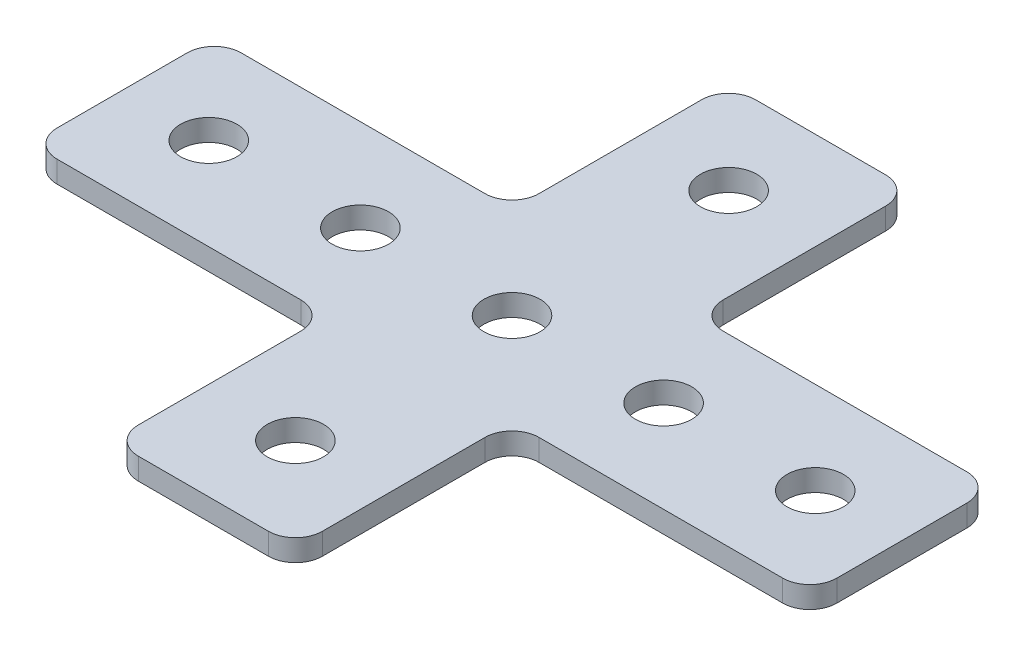
ISO-10303-21;
HEADER;
FILE_DESCRIPTION(('STEP AP214'),'2;1');
FILE_NAME('part.step','',(''),(''),'','','');
FILE_SCHEMA(('AUTOMOTIVE_DESIGN { 1 0 10303 214 1 1 1 1 }'));
ENDSEC;
DATA;
#1=APPLICATION_CONTEXT('core data for automotive mechanical design processes');
#2=APPLICATION_PROTOCOL_DEFINITION('international standard','automotive_design',2000,#1);
#3=PRODUCT_CONTEXT('',#1,'mechanical');
#4=PRODUCT('Part','Part','',(#3));
#5=PRODUCT_RELATED_PRODUCT_CATEGORY('part','',(#4));
#6=PRODUCT_DEFINITION_FORMATION('','',#4);
#7=PRODUCT_DEFINITION_CONTEXT('part definition',#1,'design');
#8=PRODUCT_DEFINITION('design','',#6,#7);
#9=PRODUCT_DEFINITION_SHAPE('','',#8);
#10=(LENGTH_UNIT() NAMED_UNIT(*) SI_UNIT(.MILLI.,.METRE.));
#11=(NAMED_UNIT(*) PLANE_ANGLE_UNIT() SI_UNIT($,.RADIAN.));
#12=(NAMED_UNIT(*) SI_UNIT($,.STERADIAN.) SOLID_ANGLE_UNIT());
#13=UNCERTAINTY_MEASURE_WITH_UNIT(LENGTH_MEASURE(1.E-05),#10,'distance_accuracy_value','');
#14=(GEOMETRIC_REPRESENTATION_CONTEXT(3) GLOBAL_UNCERTAINTY_ASSIGNED_CONTEXT((#13)) GLOBAL_UNIT_ASSIGNED_CONTEXT((#10,
#11,#12)) REPRESENTATION_CONTEXT('',''));
#15=CARTESIAN_POINT('',(0.,0.,0.));
#16=DIRECTION('',(0.,0.,1.));
#17=DIRECTION('',(1.,0.,0.));
#18=AXIS2_PLACEMENT_3D('',#15,#16,#17);
#19=CARTESIAN_POINT('',(-1.0203051665485,0.841431359764556,-0.820826933306762));
#20=DIRECTION('',(0.,-1.,0.));
#21=DIRECTION('',(0.,0.,-1.));
#22=AXIS2_PLACEMENT_3D('',#19,#20,#21);
#23=PLANE('',#22);
#24=CARTESIAN_POINT('',(-15.0203051665485,0.841431359764556,-0.820826933306748));
#25=DIRECTION('',(0.,-1.,0.));
#26=DIRECTION('',(0.,0.,1.));
#27=AXIS2_PLACEMENT_3D('',#24,#25,#26);
#28=CIRCLE('',#27,2.6);
#29=CARTESIAN_POINT('',(-15.0203051665485,0.841431359764556,1.77917306669325));
#30=VERTEX_POINT('',#29);
#31=EDGE_CURVE('E227',#30,#30,#28,.T.);
#32=ORIENTED_EDGE('',*,*,#31,.F.);
#33=EDGE_LOOP('',(#32));
#34=FACE_BOUND('',#33,.T.);
#35=CARTESIAN_POINT('',(-29.0203051665485,0.841431359764556,-0.820826933306745));
#36=DIRECTION('',(0.,-1.,0.));
#37=DIRECTION('',(0.,0.,1.));
#38=AXIS2_PLACEMENT_3D('',#35,#36,#37);
#39=CIRCLE('',#38,2.6);
#40=CARTESIAN_POINT('',(-29.0203051665485,0.841431359764556,1.77917306669325));
#41=VERTEX_POINT('',#40);
#42=EDGE_CURVE('E220',#41,#41,#39,.T.);
#43=ORIENTED_EDGE('',*,*,#42,.F.);
#44=EDGE_LOOP('',(#43));
#45=FACE_BOUND('',#44,.T.);
#46=CARTESIAN_POINT('',(-1.0203051665485,0.841431359764556,-0.820826933306762));
#47=DIRECTION('',(0.,1.,0.));
#48=DIRECTION('',(0.,0.,1.));
#49=AXIS2_PLACEMENT_3D('',#46,#47,#48);
#50=CIRCLE('',#49,2.6);
#51=CARTESIAN_POINT('',(-1.0203051665485,0.841431359764556,1.77917306669324));
#52=VERTEX_POINT('',#51);
#53=EDGE_CURVE('E269',#52,#52,#50,.T.);
#54=ORIENTED_EDGE('',*,*,#53,.T.);
#55=EDGE_LOOP('',(#54));
#56=FACE_BOUND('',#55,.T.);
#57=DIRECTION('',(1.,0.,0.));
#58=VECTOR('',#57,1.);
#59=CARTESIAN_POINT('',(-9.52030516654856,0.841431359764556,-29.3208269333067));
#60=LINE('',#59,#58);
#61=CARTESIAN_POINT('',(-7.02030516654855,0.841431359764556,-29.3208269333067));
#62=VERTEX_POINT('',#61);
#63=CARTESIAN_POINT('',(4.97969483345156,0.841431359764556,-29.3208269333067));
#64=VERTEX_POINT('',#63);
#65=EDGE_CURVE('E461',#62,#64,#60,.T.);
#66=ORIENTED_EDGE('',*,*,#65,.T.);
#67=CARTESIAN_POINT('',(4.97969483345156,0.841431359764556,-26.8208269333067));
#68=DIRECTION('',(0.,-1.,0.));
#69=DIRECTION('',(0.,0.,-1.));
#70=AXIS2_PLACEMENT_3D('',#67,#68,#69);
#71=CIRCLE('',#70,2.5);
#72=CARTESIAN_POINT('',(7.47969483345156,0.841431359764556,-26.8208269333067));
#73=VERTEX_POINT('',#72);
#74=EDGE_CURVE('E335',#64,#73,#71,.T.);
#75=ORIENTED_EDGE('',*,*,#74,.T.);
#76=DIRECTION('',(0.,0.,1.));
#77=VECTOR('',#76,1.);
#78=CARTESIAN_POINT('',(7.47969483345156,0.841431359764556,-29.3208269333067));
#79=LINE('',#78,#77);
#80=CARTESIAN_POINT('',(7.47969483345156,0.841431359764556,-11.8208269333068));
#81=VERTEX_POINT('',#80);
#82=EDGE_CURVE('E216',#73,#81,#79,.T.);
#83=ORIENTED_EDGE('',*,*,#82,.T.);
#84=CARTESIAN_POINT('',(9.97969483345156,0.841431359764556,-11.8208269333068));
#85=DIRECTION('',(0.,-1.,0.));
#86=DIRECTION('',(0.,0.,-1.));
#87=AXIS2_PLACEMENT_3D('',#84,#85,#86);
#88=CIRCLE('',#87,2.5);
#89=CARTESIAN_POINT('',(9.97969483345156,0.841431359764556,-9.3208269333068));
#90=VERTEX_POINT('',#89);
#91=EDGE_CURVE('E188',#81,#90,#88,.F.);
#92=ORIENTED_EDGE('',*,*,#91,.T.);
#93=DIRECTION('',(1.,0.,0.));
#94=VECTOR('',#93,1.);
#95=CARTESIAN_POINT('',(7.47969483345156,0.841431359764556,-9.3208269333068));
#96=LINE('',#95,#94);
#97=CARTESIAN_POINT('',(32.4796948334514,0.841431359764556,-9.3208269333068));
#98=VERTEX_POINT('',#97);
#99=EDGE_CURVE('E198',#90,#98,#96,.T.);
#100=ORIENTED_EDGE('',*,*,#99,.T.);
#101=CARTESIAN_POINT('',(32.4796948334514,0.841431359764556,-6.8208269333068));
#102=DIRECTION('',(0.,-1.,0.));
#103=DIRECTION('',(0.,0.,-1.));
#104=AXIS2_PLACEMENT_3D('',#101,#102,#103);
#105=CIRCLE('',#104,2.5);
#106=CARTESIAN_POINT('',(34.9796948334514,0.841431359764556,-6.8208269333068));
#107=VERTEX_POINT('',#106);
#108=EDGE_CURVE('E323',#98,#107,#105,.T.);
#109=ORIENTED_EDGE('',*,*,#108,.T.);
#110=DIRECTION('',(0.,0.,-1.));
#111=VECTOR('',#110,1.);
#112=CARTESIAN_POINT('',(34.9796948334515,0.841431359764556,7.67917306669328));
#113=LINE('',#112,#111);
#114=CARTESIAN_POINT('',(34.9796948334515,0.841431359764556,5.17917306669327));
#115=VERTEX_POINT('',#114);
#116=EDGE_CURVE('E278',#115,#107,#113,.T.);
#117=ORIENTED_EDGE('',*,*,#116,.F.);
#118=CARTESIAN_POINT('',(32.4796948334514,0.841431359764556,5.17917306669327));
#119=DIRECTION('',(0.,-1.,0.));
#120=DIRECTION('',(0.,0.,-1.));
#121=AXIS2_PLACEMENT_3D('',#118,#119,#120);
#122=CIRCLE('',#121,2.5);
#123=CARTESIAN_POINT('',(32.4796948334514,0.841431359764556,7.67917306669328));
#124=VERTEX_POINT('',#123);
#125=EDGE_CURVE('E325',#115,#124,#122,.T.);
#126=ORIENTED_EDGE('',*,*,#125,.T.);
#127=DIRECTION('',(1.,0.,0.));
#128=VECTOR('',#127,1.);
#129=CARTESIAN_POINT('',(7.47969483345156,0.841431359764556,7.67917306669328));
#130=LINE('',#129,#128);
#131=CARTESIAN_POINT('',(9.97969483345156,0.841431359764556,7.67917306669328));
#132=VERTEX_POINT('',#131);
#133=EDGE_CURVE('E275',#132,#124,#130,.T.);
#134=ORIENTED_EDGE('',*,*,#133,.F.);
#135=CARTESIAN_POINT('',(9.97969483345156,0.841431359764556,10.1791730666933));
#136=DIRECTION('',(0.,-1.,0.));
#137=DIRECTION('',(0.,0.,-1.));
#138=AXIS2_PLACEMENT_3D('',#135,#136,#137);
#139=CIRCLE('',#138,2.5);
#140=CARTESIAN_POINT('',(7.47969483345156,0.841431359764556,10.1791730666933));
#141=VERTEX_POINT('',#140);
#142=EDGE_CURVE('E10',#132,#141,#139,.F.);
#143=ORIENTED_EDGE('',*,*,#142,.T.);
#144=DIRECTION('',(0.,0.,-1.));
#145=VECTOR('',#144,1.);
#146=CARTESIAN_POINT('',(7.47969483345156,0.841431359764556,27.6791730666932));
#147=LINE('',#146,#145);
#148=CARTESIAN_POINT('',(7.47969483345156,0.841431359764556,25.1791730666932));
#149=VERTEX_POINT('',#148);
#150=EDGE_CURVE('E285',#149,#141,#147,.T.);
#151=ORIENTED_EDGE('',*,*,#150,.F.);
#152=CARTESIAN_POINT('',(4.97969483345156,0.841431359764556,25.1791730666932));
#153=DIRECTION('',(0.,-1.,0.));
#154=DIRECTION('',(0.,0.,-1.));
#155=AXIS2_PLACEMENT_3D('',#152,#153,#154);
#156=CIRCLE('',#155,2.5);
#157=CARTESIAN_POINT('',(4.97969483345156,0.841431359764556,27.6791730666932));
#158=VERTEX_POINT('',#157);
#159=EDGE_CURVE('E327',#149,#158,#156,.T.);
#160=ORIENTED_EDGE('',*,*,#159,.T.);
#161=DIRECTION('',(1.,0.,0.));
#162=VECTOR('',#161,1.);
#163=CARTESIAN_POINT('',(-9.52030516654856,0.841431359764556,27.6791730666932));
#164=LINE('',#163,#162);
#165=CARTESIAN_POINT('',(-7.02030516654855,0.841431359764556,27.6791730666932));
#166=VERTEX_POINT('',#165);
#167=EDGE_CURVE('E282',#166,#158,#164,.T.);
#168=ORIENTED_EDGE('',*,*,#167,.F.);
#169=CARTESIAN_POINT('',(-7.02030516654855,0.841431359764556,25.1791730666932));
#170=DIRECTION('',(0.,-1.,0.));
#171=DIRECTION('',(0.,0.,-1.));
#172=AXIS2_PLACEMENT_3D('',#169,#170,#171);
#173=CIRCLE('',#172,2.5);
#174=CARTESIAN_POINT('',(-9.52030516654855,0.841431359764556,25.1791730666932));
#175=VERTEX_POINT('',#174);
#176=EDGE_CURVE('E329',#166,#175,#173,.T.);
#177=ORIENTED_EDGE('',*,*,#176,.T.);
#178=DIRECTION('',(0.,0.,-1.));
#179=VECTOR('',#178,1.);
#180=CARTESIAN_POINT('',(-9.52030516654855,0.841431359764556,27.6791730666932));
#181=LINE('',#180,#179);
#182=CARTESIAN_POINT('',(-9.52030516654855,0.841431359764556,10.1791730666933));
#183=VERTEX_POINT('',#182);
#184=EDGE_CURVE('E240',#175,#183,#181,.T.);
#185=ORIENTED_EDGE('',*,*,#184,.T.);
#186=CARTESIAN_POINT('',(-12.0203051665486,0.841431359764556,10.1791730666933));
#187=DIRECTION('',(0.,-1.,0.));
#188=DIRECTION('',(0.,0.,-1.));
#189=AXIS2_PLACEMENT_3D('',#186,#187,#188);
#190=CIRCLE('',#189,2.5);
#191=CARTESIAN_POINT('',(-12.0203051665486,0.841431359764556,7.67917306669328));
#192=VERTEX_POINT('',#191);
#193=EDGE_CURVE('E386',#183,#192,#190,.F.);
#194=ORIENTED_EDGE('',*,*,#193,.T.);
#195=DIRECTION('',(-1.,0.,0.));
#196=VECTOR('',#195,1.);
#197=CARTESIAN_POINT('',(-9.52030516654855,0.841431359764556,7.67917306669328));
#198=LINE('',#197,#196);
#199=CARTESIAN_POINT('',(-34.5203051665484,0.841431359764556,7.67917306669328));
#200=VERTEX_POINT('',#199);
#201=EDGE_CURVE('E233',#192,#200,#198,.T.);
#202=ORIENTED_EDGE('',*,*,#201,.T.);
#203=CARTESIAN_POINT('',(-34.5203051665484,0.841431359764556,5.17917306669328));
#204=DIRECTION('',(0.,-1.,0.));
#205=DIRECTION('',(0.,0.,-1.));
#206=AXIS2_PLACEMENT_3D('',#203,#204,#205);
#207=CIRCLE('',#206,2.5);
#208=CARTESIAN_POINT('',(-37.0203051665484,0.841431359764556,5.17917306669328));
#209=VERTEX_POINT('',#208);
#210=EDGE_CURVE('E321',#200,#209,#207,.T.);
#211=ORIENTED_EDGE('',*,*,#210,.T.);
#212=DIRECTION('',(0.,0.,-1.));
#213=VECTOR('',#212,1.);
#214=CARTESIAN_POINT('',(-37.0203051665484,0.841431359764556,7.67917306669328));
#215=LINE('',#214,#213);
#216=CARTESIAN_POINT('',(-37.0203051665484,0.841431359764556,-6.82082693330681));
#217=VERTEX_POINT('',#216);
#218=EDGE_CURVE('E236',#209,#217,#215,.T.);
#219=ORIENTED_EDGE('',*,*,#218,.T.);
#220=CARTESIAN_POINT('',(-34.5203051665484,0.841431359764556,-6.82082693330681));
#221=DIRECTION('',(0.,-1.,0.));
#222=DIRECTION('',(0.,0.,-1.));
#223=AXIS2_PLACEMENT_3D('',#220,#221,#222);
#224=CIRCLE('',#223,2.5);
#225=CARTESIAN_POINT('',(-34.5203051665484,0.841431359764556,-9.32082693330681));
#226=VERTEX_POINT('',#225);
#227=EDGE_CURVE('E331',#217,#226,#224,.T.);
#228=ORIENTED_EDGE('',*,*,#227,.T.);
#229=DIRECTION('',(-1.,0.,0.));
#230=VECTOR('',#229,1.);
#231=CARTESIAN_POINT('',(-9.52030516654855,0.841431359764556,-9.3208269333068));
#232=LINE('',#231,#230);
#233=CARTESIAN_POINT('',(-12.0203051665486,0.841431359764556,-9.3208269333068));
#234=VERTEX_POINT('',#233);
#235=EDGE_CURVE('E444',#234,#226,#232,.T.);
#236=ORIENTED_EDGE('',*,*,#235,.F.);
#237=CARTESIAN_POINT('',(-12.0203051665486,0.841431359764556,-11.8208269333068));
#238=DIRECTION('',(0.,-1.,0.));
#239=DIRECTION('',(0.,0.,-1.));
#240=AXIS2_PLACEMENT_3D('',#237,#238,#239);
#241=CIRCLE('',#240,2.5);
#242=CARTESIAN_POINT('',(-9.52030516654855,0.841431359764556,-11.8208269333068));
#243=VERTEX_POINT('',#242);
#244=EDGE_CURVE('E31',#234,#243,#241,.F.);
#245=ORIENTED_EDGE('',*,*,#244,.T.);
#246=DIRECTION('',(0.,0.,1.));
#247=VECTOR('',#246,1.);
#248=CARTESIAN_POINT('',(-9.52030516654855,0.841431359764556,-29.3208269333067));
#249=LINE('',#248,#247);
#250=CARTESIAN_POINT('',(-9.52030516654855,0.841431359764556,-26.8208269333067));
#251=VERTEX_POINT('',#250);
#252=EDGE_CURVE('E450',#251,#243,#249,.T.);
#253=ORIENTED_EDGE('',*,*,#252,.F.);
#254=CARTESIAN_POINT('',(-7.02030516654855,0.841431359764556,-26.8208269333067));
#255=DIRECTION('',(0.,-1.,0.));
#256=DIRECTION('',(0.,0.,-1.));
#257=AXIS2_PLACEMENT_3D('',#254,#255,#256);
#258=CIRCLE('',#257,2.5);
#259=EDGE_CURVE('E333',#251,#62,#258,.T.);
#260=ORIENTED_EDGE('',*,*,#259,.T.);
#261=EDGE_LOOP('',(#66,#75,#83,#92,#100,#109,#117,#126,#134,#143,#151,#160,#168,#177,#185,#194,
#202,#211,#219,#228,#236,#245,#253,#260));
#262=FACE_BOUND('',#261,.T.);
#263=CARTESIAN_POINT('',(26.9796948334515,0.841431359764556,-0.820826933306751));
#264=DIRECTION('',(0.,1.,0.));
#265=DIRECTION('',(0.,0.,1.));
#266=AXIS2_PLACEMENT_3D('',#263,#264,#265);
#267=CIRCLE('',#266,2.6);
#268=CARTESIAN_POINT('',(26.9796948334515,0.841431359764556,1.77917306669325));
#269=VERTEX_POINT('',#268);
#270=EDGE_CURVE('E251',#269,#269,#267,.T.);
#271=ORIENTED_EDGE('',*,*,#270,.T.);
#272=EDGE_LOOP('',(#271));
#273=FACE_BOUND('',#272,.T.);
#274=CARTESIAN_POINT('',(-1.02030516654851,0.841431359764556,19.1791730666932));
#275=DIRECTION('',(0.,1.,0.));
#276=DIRECTION('',(0.,0.,1.));
#277=AXIS2_PLACEMENT_3D('',#274,#275,#276);
#278=CIRCLE('',#277,2.6);
#279=CARTESIAN_POINT('',(-1.02030516654851,0.841431359764556,21.7791730666932));
#280=VERTEX_POINT('',#279);
#281=EDGE_CURVE('E257',#280,#280,#278,.T.);
#282=ORIENTED_EDGE('',*,*,#281,.T.);
#283=EDGE_LOOP('',(#282));
#284=FACE_BOUND('',#283,.T.);
#285=CARTESIAN_POINT('',(12.9796948334515,0.841431359764556,-0.820826933306751));
#286=DIRECTION('',(0.,1.,0.));
#287=DIRECTION('',(0.,0.,1.));
#288=AXIS2_PLACEMENT_3D('',#285,#286,#287);
#289=CIRCLE('',#288,2.6);
#290=CARTESIAN_POINT('',(12.9796948334515,0.841431359764556,1.77917306669325));
#291=VERTEX_POINT('',#290);
#292=EDGE_CURVE('E263',#291,#291,#289,.T.);
#293=ORIENTED_EDGE('',*,*,#292,.T.);
#294=EDGE_LOOP('',(#293));
#295=FACE_BOUND('',#294,.T.);
#296=CARTESIAN_POINT('',(-1.02030516654851,0.841431359764556,-20.8208269333068));
#297=DIRECTION('',(0.,-1.,0.));
#298=DIRECTION('',(0.,0.,-1.));
#299=AXIS2_PLACEMENT_3D('',#296,#297,#298);
#300=CIRCLE('',#299,2.6);
#301=CARTESIAN_POINT('',(-1.02030516654851,0.841431359764556,-23.4208269333068));
#302=VERTEX_POINT('',#301);
#303=EDGE_CURVE('E207',#302,#302,#300,.T.);
#304=ORIENTED_EDGE('',*,*,#303,.F.);
#305=EDGE_LOOP('',(#304));
#306=FACE_BOUND('',#305,.T.);
#307=ADVANCED_FACE('F16',(#34,#45,#56,#262,#273,#284,#295,#306),#23,.T.);
#308=CARTESIAN_POINT('',(34.9796948334515,0.841431359764556,7.67917306669328));
#309=DIRECTION('',(1.,0.,0.));
#310=DIRECTION('',(0.,0.,-1.));
#311=AXIS2_PLACEMENT_3D('',#308,#309,#310);
#312=PLANE('',#311);
#313=DIRECTION('',(0.,0.,-1.));
#314=VECTOR('',#313,1.);
#315=CARTESIAN_POINT('',(34.9796948334515,2.84143135976456,7.67917306669328));
#316=LINE('',#315,#314);
#317=CARTESIAN_POINT('',(34.9796948334515,2.84143135976456,5.17917306669327));
#318=VERTEX_POINT('',#317);
#319=CARTESIAN_POINT('',(34.9796948334514,2.84143135976456,-6.8208269333068));
#320=VERTEX_POINT('',#319);
#321=EDGE_CURVE('E290',#318,#320,#316,.T.);
#322=ORIENTED_EDGE('',*,*,#321,.F.);
#323=DIRECTION('',(0.,1.,0.));
#324=VECTOR('',#323,1.);
#325=CARTESIAN_POINT('',(34.9796948334515,0.841431359764556,5.17917306669327));
#326=LINE('',#325,#324);
#327=EDGE_CURVE('E189',#318,#115,#326,.F.);
#328=ORIENTED_EDGE('',*,*,#327,.T.);
#329=ORIENTED_EDGE('',*,*,#116,.T.);
#330=DIRECTION('',(0.,1.,0.));
#331=VECTOR('',#330,1.);
#332=CARTESIAN_POINT('',(34.9796948334514,0.841431359764556,-6.8208269333068));
#333=LINE('',#332,#331);
#334=EDGE_CURVE('E376',#107,#320,#333,.T.);
#335=ORIENTED_EDGE('',*,*,#334,.T.);
#336=EDGE_LOOP('',(#322,#328,#329,#335));
#337=FACE_BOUND('',#336,.T.);
#338=ADVANCED_FACE('F493',(#337),#312,.T.);
#339=CARTESIAN_POINT('',(-1.0203051665485,2.84143135976456,-0.820826933306762));
#340=DIRECTION('',(0.,-1.,0.));
#341=DIRECTION('',(0.,0.,-1.));
#342=AXIS2_PLACEMENT_3D('',#339,#340,#341);
#343=PLANE('',#342);
#344=CARTESIAN_POINT('',(-15.0203051665485,2.84143135976456,-0.820826933306748));
#345=DIRECTION('',(0.,-1.,0.));
#346=DIRECTION('',(0.,0.,1.));
#347=AXIS2_PLACEMENT_3D('',#344,#345,#346);
#348=CIRCLE('',#347,2.6);
#349=CARTESIAN_POINT('',(-15.0203051665485,2.84143135976456,1.77917306669325));
#350=VERTEX_POINT('',#349);
#351=EDGE_CURVE('E223',#350,#350,#348,.T.);
#352=ORIENTED_EDGE('',*,*,#351,.T.);
#353=EDGE_LOOP('',(#352));
#354=FACE_BOUND('',#353,.T.);
#355=CARTESIAN_POINT('',(-29.0203051665485,2.84143135976456,-0.820826933306745));
#356=DIRECTION('',(0.,-1.,0.));
#357=DIRECTION('',(0.,0.,1.));
#358=AXIS2_PLACEMENT_3D('',#355,#356,#357);
#359=CIRCLE('',#358,2.6);
#360=CARTESIAN_POINT('',(-29.0203051665485,2.84143135976456,1.77917306669325));
#361=VERTEX_POINT('',#360);
#362=EDGE_CURVE('E224',#361,#361,#359,.T.);
#363=ORIENTED_EDGE('',*,*,#362,.T.);
#364=EDGE_LOOP('',(#363));
#365=FACE_BOUND('',#364,.T.);
#366=CARTESIAN_POINT('',(-1.0203051665485,2.84143135976456,-0.820826933306762));
#367=DIRECTION('',(0.,1.,0.));
#368=DIRECTION('',(0.,0.,1.));
#369=AXIS2_PLACEMENT_3D('',#366,#367,#368);
#370=CIRCLE('',#369,2.6);
#371=CARTESIAN_POINT('',(-1.0203051665485,2.84143135976456,1.77917306669324));
#372=VERTEX_POINT('',#371);
#373=EDGE_CURVE('E266',#372,#372,#370,.T.);
#374=ORIENTED_EDGE('',*,*,#373,.F.);
#375=EDGE_LOOP('',(#374));
#376=FACE_BOUND('',#375,.T.);
#377=DIRECTION('',(0.,0.,1.));
#378=VECTOR('',#377,1.);
#379=CARTESIAN_POINT('',(7.47969483345156,2.84143135976456,-29.3208269333067));
#380=LINE('',#379,#378);
#381=CARTESIAN_POINT('',(7.47969483345156,2.84143135976456,-26.8208269333067));
#382=VERTEX_POINT('',#381);
#383=CARTESIAN_POINT('',(7.47969483345156,2.84143135976456,-11.8208269333068));
#384=VERTEX_POINT('',#383);
#385=EDGE_CURVE('E210',#382,#384,#380,.T.);
#386=ORIENTED_EDGE('',*,*,#385,.F.);
#387=CARTESIAN_POINT('',(4.97969483345156,2.84143135976456,-26.8208269333067));
#388=DIRECTION('',(0.,-1.,0.));
#389=DIRECTION('',(0.,0.,-1.));
#390=AXIS2_PLACEMENT_3D('',#387,#388,#389);
#391=CIRCLE('',#390,2.5);
#392=CARTESIAN_POINT('',(4.97969483345156,2.84143135976456,-29.3208269333067));
#393=VERTEX_POINT('',#392);
#394=EDGE_CURVE('E314',#382,#393,#391,.F.);
#395=ORIENTED_EDGE('',*,*,#394,.T.);
#396=DIRECTION('',(1.,0.,0.));
#397=VECTOR('',#396,1.);
#398=CARTESIAN_POINT('',(-9.52030516654856,2.84143135976456,-29.3208269333067));
#399=LINE('',#398,#397);
#400=CARTESIAN_POINT('',(-7.02030516654855,2.84143135976456,-29.3208269333067));
#401=VERTEX_POINT('',#400);
#402=EDGE_CURVE('E206',#401,#393,#399,.T.);
#403=ORIENTED_EDGE('',*,*,#402,.F.);
#404=CARTESIAN_POINT('',(-7.02030516654855,2.84143135976456,-26.8208269333067));
#405=DIRECTION('',(0.,-1.,0.));
#406=DIRECTION('',(0.,0.,-1.));
#407=AXIS2_PLACEMENT_3D('',#404,#405,#406);
#408=CIRCLE('',#407,2.5);
#409=CARTESIAN_POINT('',(-9.52030516654855,2.84143135976456,-26.8208269333067));
#410=VERTEX_POINT('',#409);
#411=EDGE_CURVE('E312',#401,#410,#408,.F.);
#412=ORIENTED_EDGE('',*,*,#411,.T.);
#413=DIRECTION('',(0.,0.,1.));
#414=VECTOR('',#413,1.);
#415=CARTESIAN_POINT('',(-9.52030516654855,2.84143135976456,-29.3208269333067));
#416=LINE('',#415,#414);
#417=CARTESIAN_POINT('',(-9.52030516654855,2.84143135976456,-11.8208269333068));
#418=VERTEX_POINT('',#417);
#419=EDGE_CURVE('E451',#410,#418,#416,.T.);
#420=ORIENTED_EDGE('',*,*,#419,.T.);
#421=CARTESIAN_POINT('',(-12.0203051665486,2.84143135976456,-11.8208269333068));
#422=DIRECTION('',(0.,-1.,0.));
#423=DIRECTION('',(0.,0.,-1.));
#424=AXIS2_PLACEMENT_3D('',#421,#422,#423);
#425=CIRCLE('',#424,2.5);
#426=CARTESIAN_POINT('',(-12.0203051665486,2.84143135976456,-9.3208269333068));
#427=VERTEX_POINT('',#426);
#428=EDGE_CURVE('E381',#418,#427,#425,.T.);
#429=ORIENTED_EDGE('',*,*,#428,.T.);
#430=DIRECTION('',(-1.,0.,0.));
#431=VECTOR('',#430,1.);
#432=CARTESIAN_POINT('',(-9.52030516654855,2.84143135976456,-9.3208269333068));
#433=LINE('',#432,#431);
#434=CARTESIAN_POINT('',(-34.5203051665484,2.84143135976456,-9.32082693330681));
#435=VERTEX_POINT('',#434);
#436=EDGE_CURVE('E455',#427,#435,#433,.T.);
#437=ORIENTED_EDGE('',*,*,#436,.T.);
#438=CARTESIAN_POINT('',(-34.5203051665484,2.84143135976456,-6.82082693330681));
#439=DIRECTION('',(0.,-1.,0.));
#440=DIRECTION('',(0.,0.,-1.));
#441=AXIS2_PLACEMENT_3D('',#438,#439,#440);
#442=CIRCLE('',#441,2.5);
#443=CARTESIAN_POINT('',(-37.0203051665484,2.84143135976456,-6.82082693330681));
#444=VERTEX_POINT('',#443);
#445=EDGE_CURVE('E310',#435,#444,#442,.F.);
#446=ORIENTED_EDGE('',*,*,#445,.T.);
#447=DIRECTION('',(0.,0.,-1.));
#448=VECTOR('',#447,1.);
#449=CARTESIAN_POINT('',(-37.0203051665484,2.84143135976456,7.67917306669328));
#450=LINE('',#449,#448);
#451=CARTESIAN_POINT('',(-37.0203051665484,2.84143135976456,5.17917306669328));
#452=VERTEX_POINT('',#451);
#453=EDGE_CURVE('E246',#452,#444,#450,.T.);
#454=ORIENTED_EDGE('',*,*,#453,.F.);
#455=CARTESIAN_POINT('',(-34.5203051665484,2.84143135976456,5.17917306669328));
#456=DIRECTION('',(0.,-1.,0.));
#457=DIRECTION('',(0.,0.,-1.));
#458=AXIS2_PLACEMENT_3D('',#455,#456,#457);
#459=CIRCLE('',#458,2.5);
#460=CARTESIAN_POINT('',(-34.5203051665484,2.84143135976456,7.67917306669328));
#461=VERTEX_POINT('',#460);
#462=EDGE_CURVE('E301',#452,#461,#459,.F.);
#463=ORIENTED_EDGE('',*,*,#462,.T.);
#464=DIRECTION('',(-1.,0.,0.));
#465=VECTOR('',#464,1.);
#466=CARTESIAN_POINT('',(-9.52030516654855,2.84143135976456,7.67917306669328));
#467=LINE('',#466,#465);
#468=CARTESIAN_POINT('',(-12.0203051665486,2.84143135976456,7.67917306669328));
#469=VERTEX_POINT('',#468);
#470=EDGE_CURVE('E230',#469,#461,#467,.T.);
#471=ORIENTED_EDGE('',*,*,#470,.F.);
#472=CARTESIAN_POINT('',(-12.0203051665486,2.84143135976456,10.1791730666933));
#473=DIRECTION('',(0.,-1.,0.));
#474=DIRECTION('',(0.,0.,-1.));
#475=AXIS2_PLACEMENT_3D('',#472,#473,#474);
#476=CIRCLE('',#475,2.5);
#477=CARTESIAN_POINT('',(-9.52030516654855,2.84143135976456,10.1791730666933));
#478=VERTEX_POINT('',#477);
#479=EDGE_CURVE('E384',#469,#478,#476,.T.);
#480=ORIENTED_EDGE('',*,*,#479,.T.);
#481=DIRECTION('',(0.,0.,-1.));
#482=VECTOR('',#481,1.);
#483=CARTESIAN_POINT('',(-9.52030516654855,2.84143135976456,27.6791730666932));
#484=LINE('',#483,#482);
#485=CARTESIAN_POINT('',(-9.52030516654855,2.84143135976456,25.1791730666932));
#486=VERTEX_POINT('',#485);
#487=EDGE_CURVE('E237',#486,#478,#484,.T.);
#488=ORIENTED_EDGE('',*,*,#487,.F.);
#489=CARTESIAN_POINT('',(-7.02030516654855,2.84143135976456,25.1791730666932));
#490=DIRECTION('',(0.,-1.,0.));
#491=DIRECTION('',(0.,0.,-1.));
#492=AXIS2_PLACEMENT_3D('',#489,#490,#491);
#493=CIRCLE('',#492,2.5);
#494=CARTESIAN_POINT('',(-7.02030516654855,2.84143135976456,27.6791730666932));
#495=VERTEX_POINT('',#494);
#496=EDGE_CURVE('E308',#486,#495,#493,.F.);
#497=ORIENTED_EDGE('',*,*,#496,.T.);
#498=DIRECTION('',(1.,0.,0.));
#499=VECTOR('',#498,1.);
#500=CARTESIAN_POINT('',(-9.52030516654856,2.84143135976456,27.6791730666932));
#501=LINE('',#500,#499);
#502=CARTESIAN_POINT('',(4.97969483345156,2.84143135976456,27.6791730666932));
#503=VERTEX_POINT('',#502);
#504=EDGE_CURVE('E292',#495,#503,#501,.T.);
#505=ORIENTED_EDGE('',*,*,#504,.T.);
#506=CARTESIAN_POINT('',(4.97969483345156,2.84143135976456,25.1791730666932));
#507=DIRECTION('',(0.,-1.,0.));
#508=DIRECTION('',(0.,0.,-1.));
#509=AXIS2_PLACEMENT_3D('',#506,#507,#508);
#510=CIRCLE('',#509,2.5);
#511=CARTESIAN_POINT('',(7.47969483345156,2.84143135976456,25.1791730666932));
#512=VERTEX_POINT('',#511);
#513=EDGE_CURVE('E306',#503,#512,#510,.F.);
#514=ORIENTED_EDGE('',*,*,#513,.T.);
#515=DIRECTION('',(0.,0.,-1.));
#516=VECTOR('',#515,1.);
#517=CARTESIAN_POINT('',(7.47969483345156,2.84143135976456,27.6791730666932));
#518=LINE('',#517,#516);
#519=CARTESIAN_POINT('',(7.47969483345156,2.84143135976456,10.1791730666933));
#520=VERTEX_POINT('',#519);
#521=EDGE_CURVE('E279',#512,#520,#518,.T.);
#522=ORIENTED_EDGE('',*,*,#521,.T.);
#523=CARTESIAN_POINT('',(9.97969483345156,2.84143135976456,10.1791730666933));
#524=DIRECTION('',(0.,-1.,0.));
#525=DIRECTION('',(0.,0.,-1.));
#526=AXIS2_PLACEMENT_3D('',#523,#524,#525);
#527=CIRCLE('',#526,2.5);
#528=CARTESIAN_POINT('',(9.97969483345156,2.84143135976456,7.67917306669328));
#529=VERTEX_POINT('',#528);
#530=EDGE_CURVE('E24',#520,#529,#527,.T.);
#531=ORIENTED_EDGE('',*,*,#530,.T.);
#532=DIRECTION('',(1.,0.,0.));
#533=VECTOR('',#532,1.);
#534=CARTESIAN_POINT('',(7.47969483345156,2.84143135976456,7.67917306669328));
#535=LINE('',#534,#533);
#536=CARTESIAN_POINT('',(32.4796948334514,2.84143135976456,7.67917306669328));
#537=VERTEX_POINT('',#536);
#538=EDGE_CURVE('E272',#529,#537,#535,.T.);
#539=ORIENTED_EDGE('',*,*,#538,.T.);
#540=CARTESIAN_POINT('',(32.4796948334514,2.84143135976456,5.17917306669327));
#541=DIRECTION('',(0.,-1.,0.));
#542=DIRECTION('',(0.,0.,-1.));
#543=AXIS2_PLACEMENT_3D('',#540,#541,#542);
#544=CIRCLE('',#543,2.5);
#545=EDGE_CURVE('E304',#537,#318,#544,.F.);
#546=ORIENTED_EDGE('',*,*,#545,.T.);
#547=ORIENTED_EDGE('',*,*,#321,.T.);
#548=CARTESIAN_POINT('',(32.4796948334514,2.84143135976456,-6.8208269333068));
#549=DIRECTION('',(0.,-1.,0.));
#550=DIRECTION('',(0.,0.,-1.));
#551=AXIS2_PLACEMENT_3D('',#548,#549,#550);
#552=CIRCLE('',#551,2.5);
#553=CARTESIAN_POINT('',(32.4796948334514,2.84143135976456,-9.3208269333068));
#554=VERTEX_POINT('',#553);
#555=EDGE_CURVE('E205',#320,#554,#552,.F.);
#556=ORIENTED_EDGE('',*,*,#555,.T.);
#557=DIRECTION('',(1.,0.,0.));
#558=VECTOR('',#557,1.);
#559=CARTESIAN_POINT('',(7.47969483345156,2.84143135976456,-9.3208269333068));
#560=LINE('',#559,#558);
#561=CARTESIAN_POINT('',(9.97969483345156,2.84143135976456,-9.3208269333068));
#562=VERTEX_POINT('',#561);
#563=EDGE_CURVE('E195',#562,#554,#560,.T.);
#564=ORIENTED_EDGE('',*,*,#563,.F.);
#565=CARTESIAN_POINT('',(9.97969483345156,2.84143135976456,-11.8208269333068));
#566=DIRECTION('',(0.,-1.,0.));
#567=DIRECTION('',(0.,0.,-1.));
#568=AXIS2_PLACEMENT_3D('',#565,#566,#567);
#569=CIRCLE('',#568,2.5);
#570=EDGE_CURVE('E178',#562,#384,#569,.T.);
#571=ORIENTED_EDGE('',*,*,#570,.T.);
#572=EDGE_LOOP('',(#386,#395,#403,#412,#420,#429,#437,#446,#454,#463,#471,#480,#488,#497,#505,
#514,#522,#531,#539,#546,#547,#556,#564,#571));
#573=FACE_BOUND('',#572,.T.);
#574=CARTESIAN_POINT('',(26.9796948334515,2.84143135976456,-0.820826933306751));
#575=DIRECTION('',(0.,1.,0.));
#576=DIRECTION('',(0.,0.,1.));
#577=AXIS2_PLACEMENT_3D('',#574,#575,#576);
#578=CIRCLE('',#577,2.6);
#579=CARTESIAN_POINT('',(26.9796948334515,2.84143135976456,1.77917306669325));
#580=VERTEX_POINT('',#579);
#581=EDGE_CURVE('E243',#580,#580,#578,.T.);
#582=ORIENTED_EDGE('',*,*,#581,.F.);
#583=EDGE_LOOP('',(#582));
#584=FACE_BOUND('',#583,.T.);
#585=CARTESIAN_POINT('',(-1.02030516654851,2.84143135976456,19.1791730666932));
#586=DIRECTION('',(0.,1.,0.));
#587=DIRECTION('',(0.,0.,1.));
#588=AXIS2_PLACEMENT_3D('',#585,#586,#587);
#589=CIRCLE('',#588,2.6);
#590=CARTESIAN_POINT('',(-1.02030516654851,2.84143135976456,21.7791730666932));
#591=VERTEX_POINT('',#590);
#592=EDGE_CURVE('E254',#591,#591,#589,.T.);
#593=ORIENTED_EDGE('',*,*,#592,.F.);
#594=EDGE_LOOP('',(#593));
#595=FACE_BOUND('',#594,.T.);
#596=CARTESIAN_POINT('',(12.9796948334515,2.84143135976456,-0.820826933306751));
#597=DIRECTION('',(0.,1.,0.));
#598=DIRECTION('',(0.,0.,1.));
#599=AXIS2_PLACEMENT_3D('',#596,#597,#598);
#600=CIRCLE('',#599,2.6);
#601=CARTESIAN_POINT('',(12.9796948334515,2.84143135976456,1.77917306669325));
#602=VERTEX_POINT('',#601);
#603=EDGE_CURVE('E260',#602,#602,#600,.T.);
#604=ORIENTED_EDGE('',*,*,#603,.F.);
#605=EDGE_LOOP('',(#604));
#606=FACE_BOUND('',#605,.T.);
#607=CARTESIAN_POINT('',(-1.02030516654851,2.84143135976456,-20.8208269333068));
#608=DIRECTION('',(0.,-1.,0.));
#609=DIRECTION('',(0.,0.,-1.));
#610=AXIS2_PLACEMENT_3D('',#607,#608,#609);
#611=CIRCLE('',#610,2.6);
#612=CARTESIAN_POINT('',(-1.02030516654851,2.84143135976456,-23.4208269333068));
#613=VERTEX_POINT('',#612);
#614=EDGE_CURVE('E213',#613,#613,#611,.T.);
#615=ORIENTED_EDGE('',*,*,#614,.T.);
#616=EDGE_LOOP('',(#615));
#617=FACE_BOUND('',#616,.T.);
#618=ADVANCED_FACE('F202',(#354,#365,#376,#573,#584,#595,#606,#617),#343,.F.);
#619=CARTESIAN_POINT('',(-1.0203051665485,0.841431359764556,-0.820826933306762));
#620=DIRECTION('',(0.,1.,0.));
#621=DIRECTION('',(0.,0.,1.));
#622=AXIS2_PLACEMENT_3D('',#619,#620,#621);
#623=CYLINDRICAL_SURFACE('',#622,2.6);
#624=ORIENTED_EDGE('',*,*,#53,.F.);
#625=EDGE_LOOP('',(#624));
#626=FACE_BOUND('',#625,.T.);
#627=ORIENTED_EDGE('',*,*,#373,.T.);
#628=EDGE_LOOP('',(#627));
#629=FACE_BOUND('',#628,.T.);
#630=ADVANCED_FACE('F736',(#626,#629),#623,.F.);
#631=CARTESIAN_POINT('',(12.9796948334515,0.841431359764556,-0.820826933306751));
#632=DIRECTION('',(0.,1.,0.));
#633=DIRECTION('',(0.,0.,1.));
#634=AXIS2_PLACEMENT_3D('',#631,#632,#633);
#635=CYLINDRICAL_SURFACE('',#634,2.6);
#636=ORIENTED_EDGE('',*,*,#603,.T.);
#637=EDGE_LOOP('',(#636));
#638=FACE_BOUND('',#637,.T.);
#639=ORIENTED_EDGE('',*,*,#292,.F.);
#640=EDGE_LOOP('',(#639));
#641=FACE_BOUND('',#640,.T.);
#642=ADVANCED_FACE('F727',(#638,#641),#635,.F.);
#643=CARTESIAN_POINT('',(26.9796948334515,0.841431359764556,-0.820826933306751));
#644=DIRECTION('',(0.,1.,0.));
#645=DIRECTION('',(0.,0.,1.));
#646=AXIS2_PLACEMENT_3D('',#643,#644,#645);
#647=CYLINDRICAL_SURFACE('',#646,2.6);
#648=ORIENTED_EDGE('',*,*,#581,.T.);
#649=EDGE_LOOP('',(#648));
#650=FACE_BOUND('',#649,.T.);
#651=ORIENTED_EDGE('',*,*,#270,.F.);
#652=EDGE_LOOP('',(#651));
#653=FACE_BOUND('',#652,.T.);
#654=ADVANCED_FACE('F719',(#650,#653),#647,.F.);
#655=CARTESIAN_POINT('',(-37.0203051665484,0.841431359764556,7.67917306669328));
#656=DIRECTION('',(-1.,0.,0.));
#657=DIRECTION('',(0.,0.,-1.));
#658=AXIS2_PLACEMENT_3D('',#655,#656,#657);
#659=PLANE('',#658);
#660=ORIENTED_EDGE('',*,*,#453,.T.);
#661=DIRECTION('',(0.,1.,0.));
#662=VECTOR('',#661,1.);
#663=CARTESIAN_POINT('',(-37.0203051665484,0.841431359764556,-6.82082693330681));
#664=LINE('',#663,#662);
#665=EDGE_CURVE('E349',#444,#217,#664,.F.);
#666=ORIENTED_EDGE('',*,*,#665,.T.);
#667=ORIENTED_EDGE('',*,*,#218,.F.);
#668=DIRECTION('',(0.,1.,0.));
#669=VECTOR('',#668,1.);
#670=CARTESIAN_POINT('',(-37.0203051665484,0.841431359764556,5.17917306669328));
#671=LINE('',#670,#669);
#672=EDGE_CURVE('E346',#209,#452,#671,.T.);
#673=ORIENTED_EDGE('',*,*,#672,.T.);
#674=EDGE_LOOP('',(#660,#666,#667,#673));
#675=FACE_BOUND('',#674,.T.);
#676=ADVANCED_FACE('F437',(#675),#659,.T.);
#677=CARTESIAN_POINT('',(-15.0203051665485,0.841431359764556,-0.820826933306748));
#678=DIRECTION('',(0.,1.,0.));
#679=DIRECTION('',(0.,0.,1.));
#680=AXIS2_PLACEMENT_3D('',#677,#678,#679);
#681=CYLINDRICAL_SURFACE('',#680,2.6);
#682=ORIENTED_EDGE('',*,*,#31,.T.);
#683=EDGE_LOOP('',(#682));
#684=FACE_BOUND('',#683,.T.);
#685=ORIENTED_EDGE('',*,*,#351,.F.);
#686=EDGE_LOOP('',(#685));
#687=FACE_BOUND('',#686,.T.);
#688=ADVANCED_FACE('F702',(#684,#687),#681,.F.);
#689=CARTESIAN_POINT('',(-29.0203051665485,0.841431359764556,-0.820826933306745));
#690=DIRECTION('',(0.,1.,0.));
#691=DIRECTION('',(0.,0.,1.));
#692=AXIS2_PLACEMENT_3D('',#689,#690,#691);
#693=CYLINDRICAL_SURFACE('',#692,2.6);
#694=ORIENTED_EDGE('',*,*,#362,.F.);
#695=EDGE_LOOP('',(#694));
#696=FACE_BOUND('',#695,.T.);
#697=ORIENTED_EDGE('',*,*,#42,.T.);
#698=EDGE_LOOP('',(#697));
#699=FACE_BOUND('',#698,.T.);
#700=ADVANCED_FACE('F695',(#696,#699),#693,.F.);
#701=CARTESIAN_POINT('',(7.47969483345156,0.841431359764556,7.67917306669328));
#702=DIRECTION('',(0.,0.,1.));
#703=DIRECTION('',(1.,0.,0.));
#704=AXIS2_PLACEMENT_3D('',#701,#702,#703);
#705=PLANE('',#704);
#706=ORIENTED_EDGE('',*,*,#538,.F.);
#707=DIRECTION('',(0.,1.,0.));
#708=VECTOR('',#707,1.);
#709=CARTESIAN_POINT('',(9.97969483345156,0.841431359764556,7.67917306669328));
#710=LINE('',#709,#708);
#711=EDGE_CURVE('E374',#529,#132,#710,.F.);
#712=ORIENTED_EDGE('',*,*,#711,.T.);
#713=ORIENTED_EDGE('',*,*,#133,.T.);
#714=DIRECTION('',(0.,1.,0.));
#715=VECTOR('',#714,1.);
#716=CARTESIAN_POINT('',(32.4796948334514,0.841431359764556,7.67917306669328));
#717=LINE('',#716,#715);
#718=EDGE_CURVE('E371',#124,#537,#717,.T.);
#719=ORIENTED_EDGE('',*,*,#718,.T.);
#720=EDGE_LOOP('',(#706,#712,#713,#719));
#721=FACE_BOUND('',#720,.T.);
#722=ADVANCED_FACE('F393',(#721),#705,.T.);
#723=CARTESIAN_POINT('',(7.47969483345156,0.841431359764556,27.6791730666932));
#724=DIRECTION('',(1.,0.,0.));
#725=DIRECTION('',(0.,0.,-1.));
#726=AXIS2_PLACEMENT_3D('',#723,#724,#725);
#727=PLANE('',#726);
#728=ORIENTED_EDGE('',*,*,#521,.F.);
#729=DIRECTION('',(0.,1.,0.));
#730=VECTOR('',#729,1.);
#731=CARTESIAN_POINT('',(7.47969483345156,0.841431359764556,25.1791730666932));
#732=LINE('',#731,#730);
#733=EDGE_CURVE('E369',#512,#149,#732,.F.);
#734=ORIENTED_EDGE('',*,*,#733,.T.);
#735=ORIENTED_EDGE('',*,*,#150,.T.);
#736=DIRECTION('',(0.,1.,0.));
#737=VECTOR('',#736,1.);
#738=CARTESIAN_POINT('',(7.47969483345156,2.84143135976456,10.1791730666933));
#739=LINE('',#738,#737);
#740=EDGE_CURVE('E366',#141,#520,#739,.T.);
#741=ORIENTED_EDGE('',*,*,#740,.T.);
#742=EDGE_LOOP('',(#728,#734,#735,#741));
#743=FACE_BOUND('',#742,.T.);
#744=ADVANCED_FACE('F403',(#743),#727,.T.);
#745=CARTESIAN_POINT('',(-9.52030516654856,0.841431359764556,27.6791730666932));
#746=DIRECTION('',(0.,0.,1.));
#747=DIRECTION('',(1.,0.,0.));
#748=AXIS2_PLACEMENT_3D('',#745,#746,#747);
#749=PLANE('',#748);
#750=ORIENTED_EDGE('',*,*,#504,.F.);
#751=DIRECTION('',(0.,1.,0.));
#752=VECTOR('',#751,1.);
#753=CARTESIAN_POINT('',(-7.02030516654855,0.841431359764556,27.6791730666932));
#754=LINE('',#753,#752);
#755=EDGE_CURVE('E364',#495,#166,#754,.F.);
#756=ORIENTED_EDGE('',*,*,#755,.T.);
#757=ORIENTED_EDGE('',*,*,#167,.T.);
#758=DIRECTION('',(0.,1.,0.));
#759=VECTOR('',#758,1.);
#760=CARTESIAN_POINT('',(4.97969483345156,0.841431359764556,27.6791730666932));
#761=LINE('',#760,#759);
#762=EDGE_CURVE('E361',#158,#503,#761,.T.);
#763=ORIENTED_EDGE('',*,*,#762,.T.);
#764=EDGE_LOOP('',(#750,#756,#757,#763));
#765=FACE_BOUND('',#764,.T.);
#766=ADVANCED_FACE('F412',(#765),#749,.T.);
#767=CARTESIAN_POINT('',(-1.02030516654851,0.841431359764556,19.1791730666932));
#768=DIRECTION('',(0.,1.,0.));
#769=DIRECTION('',(0.,0.,1.));
#770=AXIS2_PLACEMENT_3D('',#767,#768,#769);
#771=CYLINDRICAL_SURFACE('',#770,2.6);
#772=ORIENTED_EDGE('',*,*,#592,.T.);
#773=EDGE_LOOP('',(#772));
#774=FACE_BOUND('',#773,.T.);
#775=ORIENTED_EDGE('',*,*,#281,.F.);
#776=EDGE_LOOP('',(#775));
#777=FACE_BOUND('',#776,.T.);
#778=ADVANCED_FACE('F665',(#774,#777),#771,.F.);
#779=CARTESIAN_POINT('',(-9.52030516654855,0.841431359764556,7.67917306669328));
#780=DIRECTION('',(0.,0.,1.));
#781=DIRECTION('',(-1.,0.,0.));
#782=AXIS2_PLACEMENT_3D('',#779,#780,#781);
#783=PLANE('',#782);
#784=ORIENTED_EDGE('',*,*,#201,.F.);
#785=DIRECTION('',(0.,1.,0.));
#786=VECTOR('',#785,1.);
#787=CARTESIAN_POINT('',(-12.0203051665486,2.84143135976456,7.67917306669328));
#788=LINE('',#787,#786);
#789=EDGE_CURVE('E353',#192,#469,#788,.T.);
#790=ORIENTED_EDGE('',*,*,#789,.T.);
#791=ORIENTED_EDGE('',*,*,#470,.T.);
#792=DIRECTION('',(0.,1.,0.));
#793=VECTOR('',#792,1.);
#794=CARTESIAN_POINT('',(-34.5203051665484,0.841431359764556,7.67917306669328));
#795=LINE('',#794,#793);
#796=EDGE_CURVE('E351',#461,#200,#795,.F.);
#797=ORIENTED_EDGE('',*,*,#796,.T.);
#798=EDGE_LOOP('',(#784,#790,#791,#797));
#799=FACE_BOUND('',#798,.T.);
#800=ADVANCED_FACE('F429',(#799),#783,.T.);
#801=CARTESIAN_POINT('',(-9.52030516654855,0.841431359764556,27.6791730666932));
#802=DIRECTION('',(-1.,0.,0.));
#803=DIRECTION('',(0.,0.,-1.));
#804=AXIS2_PLACEMENT_3D('',#801,#802,#803);
#805=PLANE('',#804);
#806=ORIENTED_EDGE('',*,*,#487,.T.);
#807=DIRECTION('',(0.,1.,0.));
#808=VECTOR('',#807,1.);
#809=CARTESIAN_POINT('',(-9.52030516654855,0.841431359764556,10.1791730666933));
#810=LINE('',#809,#808);
#811=EDGE_CURVE('E359',#478,#183,#810,.F.);
#812=ORIENTED_EDGE('',*,*,#811,.T.);
#813=ORIENTED_EDGE('',*,*,#184,.F.);
#814=DIRECTION('',(0.,1.,0.));
#815=VECTOR('',#814,1.);
#816=CARTESIAN_POINT('',(-9.52030516654855,0.841431359764556,25.1791730666932));
#817=LINE('',#816,#815);
#818=EDGE_CURVE('E356',#175,#486,#817,.T.);
#819=ORIENTED_EDGE('',*,*,#818,.T.);
#820=EDGE_LOOP('',(#806,#812,#813,#819));
#821=FACE_BOUND('',#820,.T.);
#822=ADVANCED_FACE('F420',(#821),#805,.T.);
#823=CARTESIAN_POINT('',(7.47969483345156,0.841431359764556,-9.3208269333068));
#824=DIRECTION('',(0.,0.,-1.));
#825=DIRECTION('',(1.,0.,0.));
#826=AXIS2_PLACEMENT_3D('',#823,#824,#825);
#827=PLANE('',#826);
#828=ORIENTED_EDGE('',*,*,#99,.F.);
#829=DIRECTION('',(0.,1.,0.));
#830=VECTOR('',#829,1.);
#831=CARTESIAN_POINT('',(9.97969483345156,2.84143135976456,-9.3208269333068));
#832=LINE('',#831,#830);
#833=EDGE_CURVE('E182',#90,#562,#832,.T.);
#834=ORIENTED_EDGE('',*,*,#833,.T.);
#835=ORIENTED_EDGE('',*,*,#563,.T.);
#836=DIRECTION('',(0.,1.,0.));
#837=VECTOR('',#836,1.);
#838=CARTESIAN_POINT('',(32.4796948334514,0.841431359764556,-9.3208269333068));
#839=LINE('',#838,#837);
#840=EDGE_CURVE('E200',#554,#98,#839,.F.);
#841=ORIENTED_EDGE('',*,*,#840,.T.);
#842=EDGE_LOOP('',(#828,#834,#835,#841));
#843=FACE_BOUND('',#842,.T.);
#844=ADVANCED_FACE('F194',(#843),#827,.T.);
#845=CARTESIAN_POINT('',(7.47969483345156,0.841431359764556,-29.3208269333067));
#846=DIRECTION('',(1.,0.,0.));
#847=DIRECTION('',(0.,0.,1.));
#848=AXIS2_PLACEMENT_3D('',#845,#846,#847);
#849=PLANE('',#848);
#850=ORIENTED_EDGE('',*,*,#385,.T.);
#851=DIRECTION('',(0.,1.,0.));
#852=VECTOR('',#851,1.);
#853=CARTESIAN_POINT('',(7.47969483345156,0.841431359764556,-11.8208269333068));
#854=LINE('',#853,#852);
#855=EDGE_CURVE('E183',#384,#81,#854,.F.);
#856=ORIENTED_EDGE('',*,*,#855,.T.);
#857=ORIENTED_EDGE('',*,*,#82,.F.);
#858=DIRECTION('',(0.,1.,0.));
#859=VECTOR('',#858,1.);
#860=CARTESIAN_POINT('',(7.47969483345156,0.841431359764556,-26.8208269333067));
#861=LINE('',#860,#859);
#862=EDGE_CURVE('E199',#73,#382,#861,.T.);
#863=ORIENTED_EDGE('',*,*,#862,.T.);
#864=EDGE_LOOP('',(#850,#856,#857,#863));
#865=FACE_BOUND('',#864,.T.);
#866=ADVANCED_FACE('F468',(#865),#849,.T.);
#867=CARTESIAN_POINT('',(-9.52030516654856,0.841431359764556,-29.3208269333067));
#868=DIRECTION('',(0.,0.,-1.));
#869=DIRECTION('',(1.,0.,0.));
#870=AXIS2_PLACEMENT_3D('',#867,#868,#869);
#871=PLANE('',#870);
#872=ORIENTED_EDGE('',*,*,#402,.T.);
#873=DIRECTION('',(0.,1.,0.));
#874=VECTOR('',#873,1.);
#875=CARTESIAN_POINT('',(4.97969483345156,0.841431359764556,-29.3208269333067));
#876=LINE('',#875,#874);
#877=EDGE_CURVE('E319',#393,#64,#876,.F.);
#878=ORIENTED_EDGE('',*,*,#877,.T.);
#879=ORIENTED_EDGE('',*,*,#65,.F.);
#880=DIRECTION('',(0.,1.,0.));
#881=VECTOR('',#880,1.);
#882=CARTESIAN_POINT('',(-7.02030516654855,0.841431359764556,-29.3208269333067));
#883=LINE('',#882,#881);
#884=EDGE_CURVE('E316',#62,#401,#883,.T.);
#885=ORIENTED_EDGE('',*,*,#884,.T.);
#886=EDGE_LOOP('',(#872,#878,#879,#885));
#887=FACE_BOUND('',#886,.T.);
#888=ADVANCED_FACE('F474',(#887),#871,.T.);
#889=CARTESIAN_POINT('',(-1.02030516654851,0.841431359764556,-20.8208269333068));
#890=DIRECTION('',(0.,1.,0.));
#891=DIRECTION('',(0.,0.,-1.));
#892=AXIS2_PLACEMENT_3D('',#889,#890,#891);
#893=CYLINDRICAL_SURFACE('',#892,2.6);
#894=ORIENTED_EDGE('',*,*,#614,.F.);
#895=EDGE_LOOP('',(#894));
#896=FACE_BOUND('',#895,.T.);
#897=ORIENTED_EDGE('',*,*,#303,.T.);
#898=EDGE_LOOP('',(#897));
#899=FACE_BOUND('',#898,.T.);
#900=ADVANCED_FACE('F621',(#896,#899),#893,.F.);
#901=CARTESIAN_POINT('',(-9.52030516654855,0.841431359764556,-9.3208269333068));
#902=DIRECTION('',(0.,0.,-1.));
#903=DIRECTION('',(-1.,0.,0.));
#904=AXIS2_PLACEMENT_3D('',#901,#902,#903);
#905=PLANE('',#904);
#906=ORIENTED_EDGE('',*,*,#436,.F.);
#907=DIRECTION('',(0.,1.,0.));
#908=VECTOR('',#907,1.);
#909=CARTESIAN_POINT('',(-12.0203051665486,0.841431359764556,-9.3208269333068));
#910=LINE('',#909,#908);
#911=EDGE_CURVE('E344',#427,#234,#910,.F.);
#912=ORIENTED_EDGE('',*,*,#911,.T.);
#913=ORIENTED_EDGE('',*,*,#235,.T.);
#914=DIRECTION('',(0.,1.,0.));
#915=VECTOR('',#914,1.);
#916=CARTESIAN_POINT('',(-34.5203051665484,0.841431359764556,-9.32082693330681));
#917=LINE('',#916,#915);
#918=EDGE_CURVE('E341',#226,#435,#917,.T.);
#919=ORIENTED_EDGE('',*,*,#918,.T.);
#920=EDGE_LOOP('',(#906,#912,#913,#919));
#921=FACE_BOUND('',#920,.T.);
#922=ADVANCED_FACE('F447',(#921),#905,.T.);
#923=CARTESIAN_POINT('',(-9.52030516654855,0.841431359764556,-29.3208269333067));
#924=DIRECTION('',(-1.,0.,0.));
#925=DIRECTION('',(0.,0.,1.));
#926=AXIS2_PLACEMENT_3D('',#923,#924,#925);
#927=PLANE('',#926);
#928=ORIENTED_EDGE('',*,*,#419,.F.);
#929=DIRECTION('',(0.,1.,0.));
#930=VECTOR('',#929,1.);
#931=CARTESIAN_POINT('',(-9.52030516654855,0.841431359764556,-26.8208269333067));
#932=LINE('',#931,#930);
#933=EDGE_CURVE('E38',#410,#251,#932,.F.);
#934=ORIENTED_EDGE('',*,*,#933,.T.);
#935=ORIENTED_EDGE('',*,*,#252,.T.);
#936=DIRECTION('',(0.,1.,0.));
#937=VECTOR('',#936,1.);
#938=CARTESIAN_POINT('',(-9.52030516654855,2.84143135976456,-11.8208269333068));
#939=LINE('',#938,#937);
#940=EDGE_CURVE('E337',#243,#418,#939,.T.);
#941=ORIENTED_EDGE('',*,*,#940,.T.);
#942=EDGE_LOOP('',(#928,#934,#935,#941));
#943=FACE_BOUND('',#942,.T.);
#944=ADVANCED_FACE('F479',(#943),#927,.T.);
#945=CARTESIAN_POINT('',(9.97969483345156,0.841431359764556,-11.8208269333068));
#946=DIRECTION('',(0.,-1.,0.));
#947=DIRECTION('',(0.,0.,-1.));
#948=AXIS2_PLACEMENT_3D('',#945,#946,#947);
#949=CYLINDRICAL_SURFACE('',#948,2.5);
#950=ORIENTED_EDGE('',*,*,#91,.F.);
#951=ORIENTED_EDGE('',*,*,#855,.F.);
#952=ORIENTED_EDGE('',*,*,#570,.F.);
#953=ORIENTED_EDGE('',*,*,#833,.F.);
#954=EDGE_LOOP('',(#950,#951,#952,#953));
#955=FACE_BOUND('',#954,.T.);
#956=ADVANCED_FACE('F181',(#955),#949,.F.);
#957=CARTESIAN_POINT('',(4.97969483345156,0.841431359764556,-26.8208269333067));
#958=DIRECTION('',(0.,1.,0.));
#959=DIRECTION('',(0.,0.,1.));
#960=AXIS2_PLACEMENT_3D('',#957,#958,#959);
#961=CYLINDRICAL_SURFACE('',#960,2.5);
#962=ORIENTED_EDGE('',*,*,#74,.F.);
#963=ORIENTED_EDGE('',*,*,#877,.F.);
#964=ORIENTED_EDGE('',*,*,#394,.F.);
#965=ORIENTED_EDGE('',*,*,#862,.F.);
#966=EDGE_LOOP('',(#962,#963,#964,#965));
#967=FACE_BOUND('',#966,.T.);
#968=ADVANCED_FACE('F470',(#967),#961,.T.);
#969=CARTESIAN_POINT('',(-7.02030516654855,0.841431359764556,-26.8208269333067));
#970=DIRECTION('',(0.,1.,0.));
#971=DIRECTION('',(0.,0.,1.));
#972=AXIS2_PLACEMENT_3D('',#969,#970,#971);
#973=CYLINDRICAL_SURFACE('',#972,2.5);
#974=ORIENTED_EDGE('',*,*,#259,.F.);
#975=ORIENTED_EDGE('',*,*,#933,.F.);
#976=ORIENTED_EDGE('',*,*,#411,.F.);
#977=ORIENTED_EDGE('',*,*,#884,.F.);
#978=EDGE_LOOP('',(#974,#975,#976,#977));
#979=FACE_BOUND('',#978,.T.);
#980=ADVANCED_FACE('F478',(#979),#973,.T.);
#981=CARTESIAN_POINT('',(-12.0203051665486,0.841431359764556,-11.8208269333068));
#982=DIRECTION('',(0.,-1.,0.));
#983=DIRECTION('',(0.,0.,-1.));
#984=AXIS2_PLACEMENT_3D('',#981,#982,#983);
#985=CYLINDRICAL_SURFACE('',#984,2.5);
#986=ORIENTED_EDGE('',*,*,#244,.F.);
#987=ORIENTED_EDGE('',*,*,#911,.F.);
#988=ORIENTED_EDGE('',*,*,#428,.F.);
#989=ORIENTED_EDGE('',*,*,#940,.F.);
#990=EDGE_LOOP('',(#986,#987,#988,#989));
#991=FACE_BOUND('',#990,.T.);
#992=ADVANCED_FACE('F482',(#991),#985,.F.);
#993=CARTESIAN_POINT('',(-34.5203051665484,0.841431359764556,-6.82082693330681));
#994=DIRECTION('',(0.,1.,0.));
#995=DIRECTION('',(0.,0.,1.));
#996=AXIS2_PLACEMENT_3D('',#993,#994,#995);
#997=CYLINDRICAL_SURFACE('',#996,2.5);
#998=ORIENTED_EDGE('',*,*,#227,.F.);
#999=ORIENTED_EDGE('',*,*,#665,.F.);
#1000=ORIENTED_EDGE('',*,*,#445,.F.);
#1001=ORIENTED_EDGE('',*,*,#918,.F.);
#1002=EDGE_LOOP('',(#998,#999,#1000,#1001));
#1003=FACE_BOUND('',#1002,.T.);
#1004=ADVANCED_FACE('F441',(#1003),#997,.T.);
#1005=CARTESIAN_POINT('',(-12.0203051665486,0.841431359764556,10.1791730666933));
#1006=DIRECTION('',(0.,-1.,0.));
#1007=DIRECTION('',(0.,0.,-1.));
#1008=AXIS2_PLACEMENT_3D('',#1005,#1006,#1007);
#1009=CYLINDRICAL_SURFACE('',#1008,2.5);
#1010=ORIENTED_EDGE('',*,*,#193,.F.);
#1011=ORIENTED_EDGE('',*,*,#811,.F.);
#1012=ORIENTED_EDGE('',*,*,#479,.F.);
#1013=ORIENTED_EDGE('',*,*,#789,.F.);
#1014=EDGE_LOOP('',(#1010,#1011,#1012,#1013));
#1015=FACE_BOUND('',#1014,.T.);
#1016=ADVANCED_FACE('F424',(#1015),#1009,.F.);
#1017=CARTESIAN_POINT('',(-7.02030516654855,0.841431359764556,25.1791730666932));
#1018=DIRECTION('',(0.,1.,0.));
#1019=DIRECTION('',(0.,0.,1.));
#1020=AXIS2_PLACEMENT_3D('',#1017,#1018,#1019);
#1021=CYLINDRICAL_SURFACE('',#1020,2.5);
#1022=ORIENTED_EDGE('',*,*,#176,.F.);
#1023=ORIENTED_EDGE('',*,*,#755,.F.);
#1024=ORIENTED_EDGE('',*,*,#496,.F.);
#1025=ORIENTED_EDGE('',*,*,#818,.F.);
#1026=EDGE_LOOP('',(#1022,#1023,#1024,#1025));
#1027=FACE_BOUND('',#1026,.T.);
#1028=ADVANCED_FACE('F415',(#1027),#1021,.T.);
#1029=CARTESIAN_POINT('',(4.97969483345156,0.841431359764556,25.1791730666932));
#1030=DIRECTION('',(0.,1.,0.));
#1031=DIRECTION('',(0.,0.,1.));
#1032=AXIS2_PLACEMENT_3D('',#1029,#1030,#1031);
#1033=CYLINDRICAL_SURFACE('',#1032,2.5);
#1034=ORIENTED_EDGE('',*,*,#159,.F.);
#1035=ORIENTED_EDGE('',*,*,#733,.F.);
#1036=ORIENTED_EDGE('',*,*,#513,.F.);
#1037=ORIENTED_EDGE('',*,*,#762,.F.);
#1038=EDGE_LOOP('',(#1034,#1035,#1036,#1037));
#1039=FACE_BOUND('',#1038,.T.);
#1040=ADVANCED_FACE('F406',(#1039),#1033,.T.);
#1041=CARTESIAN_POINT('',(9.97969483345156,0.841431359764556,10.1791730666933));
#1042=DIRECTION('',(0.,-1.,0.));
#1043=DIRECTION('',(0.,0.,-1.));
#1044=AXIS2_PLACEMENT_3D('',#1041,#1042,#1043);
#1045=CYLINDRICAL_SURFACE('',#1044,2.5);
#1046=ORIENTED_EDGE('',*,*,#142,.F.);
#1047=ORIENTED_EDGE('',*,*,#711,.F.);
#1048=ORIENTED_EDGE('',*,*,#530,.F.);
#1049=ORIENTED_EDGE('',*,*,#740,.F.);
#1050=EDGE_LOOP('',(#1046,#1047,#1048,#1049));
#1051=FACE_BOUND('',#1050,.T.);
#1052=ADVANCED_FACE('F397',(#1051),#1045,.F.);
#1053=CARTESIAN_POINT('',(32.4796948334514,0.841431359764556,5.17917306669327));
#1054=DIRECTION('',(0.,1.,0.));
#1055=DIRECTION('',(0.,0.,1.));
#1056=AXIS2_PLACEMENT_3D('',#1053,#1054,#1055);
#1057=CYLINDRICAL_SURFACE('',#1056,2.5);
#1058=ORIENTED_EDGE('',*,*,#125,.F.);
#1059=ORIENTED_EDGE('',*,*,#327,.F.);
#1060=ORIENTED_EDGE('',*,*,#545,.F.);
#1061=ORIENTED_EDGE('',*,*,#718,.F.);
#1062=EDGE_LOOP('',(#1058,#1059,#1060,#1061));
#1063=FACE_BOUND('',#1062,.T.);
#1064=ADVANCED_FACE('F566',(#1063),#1057,.T.);
#1065=CARTESIAN_POINT('',(32.4796948334514,0.841431359764556,-6.8208269333068));
#1066=DIRECTION('',(0.,1.,0.));
#1067=DIRECTION('',(0.,0.,1.));
#1068=AXIS2_PLACEMENT_3D('',#1065,#1066,#1067);
#1069=CYLINDRICAL_SURFACE('',#1068,2.5);
#1070=ORIENTED_EDGE('',*,*,#108,.F.);
#1071=ORIENTED_EDGE('',*,*,#840,.F.);
#1072=ORIENTED_EDGE('',*,*,#555,.F.);
#1073=ORIENTED_EDGE('',*,*,#334,.F.);
#1074=EDGE_LOOP('',(#1070,#1071,#1072,#1073));
#1075=FACE_BOUND('',#1074,.T.);
#1076=ADVANCED_FACE('F575',(#1075),#1069,.T.);
#1077=CARTESIAN_POINT('',(-34.5203051665484,0.841431359764556,5.17917306669328));
#1078=DIRECTION('',(0.,1.,0.));
#1079=DIRECTION('',(0.,0.,1.));
#1080=AXIS2_PLACEMENT_3D('',#1077,#1078,#1079);
#1081=CYLINDRICAL_SURFACE('',#1080,2.5);
#1082=ORIENTED_EDGE('',*,*,#210,.F.);
#1083=ORIENTED_EDGE('',*,*,#796,.F.);
#1084=ORIENTED_EDGE('',*,*,#462,.F.);
#1085=ORIENTED_EDGE('',*,*,#672,.F.);
#1086=EDGE_LOOP('',(#1082,#1083,#1084,#1085));
#1087=FACE_BOUND('',#1086,.T.);
#1088=ADVANCED_FACE('F18',(#1087),#1081,.T.);
#1089=CLOSED_SHELL('',(#307,#338,#618,#630,#642,#654,#676,#688,#700,#722,#744,#766,#778,#800,
#822,#844,#866,#888,#900,#922,#944,#956,#968,#980,#992,#1004,#1016,#1028,#1040,#1052,#1064,
#1076,#1088));
#1090=MANIFOLD_SOLID_BREP('B1',#1089);
#1091=ADVANCED_BREP_SHAPE_REPRESENTATION('',(#18,#1090),#14);
#1092=SHAPE_DEFINITION_REPRESENTATION(#9,#1091);
ENDSEC;
END-ISO-10303-21;
